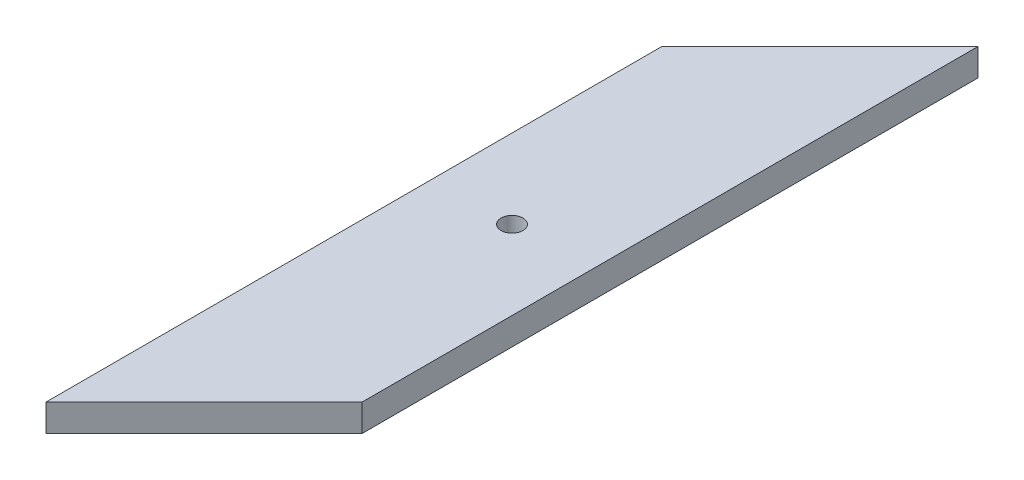
ISO-10303-21;
HEADER;
FILE_DESCRIPTION(('STEP AP214'),'2;1');
FILE_NAME('part.step','',(''),(''),'','','');
FILE_SCHEMA(('AUTOMOTIVE_DESIGN { 1 0 10303 214 1 1 1 1 }'));
ENDSEC;
DATA;
#1=APPLICATION_CONTEXT('core data for automotive mechanical design processes');
#2=APPLICATION_PROTOCOL_DEFINITION('international standard','automotive_design',2000,#1);
#3=PRODUCT_CONTEXT('',#1,'mechanical');
#4=PRODUCT('Part','Part','',(#3));
#5=PRODUCT_RELATED_PRODUCT_CATEGORY('part','',(#4));
#6=PRODUCT_DEFINITION_FORMATION('','',#4);
#7=PRODUCT_DEFINITION_CONTEXT('part definition',#1,'design');
#8=PRODUCT_DEFINITION('design','',#6,#7);
#9=PRODUCT_DEFINITION_SHAPE('','',#8);
#10=(LENGTH_UNIT() NAMED_UNIT(*) SI_UNIT(.MILLI.,.METRE.));
#11=(NAMED_UNIT(*) PLANE_ANGLE_UNIT() SI_UNIT($,.RADIAN.));
#12=(NAMED_UNIT(*) SI_UNIT($,.STERADIAN.) SOLID_ANGLE_UNIT());
#13=UNCERTAINTY_MEASURE_WITH_UNIT(LENGTH_MEASURE(1.E-05),#10,'distance_accuracy_value','');
#14=(GEOMETRIC_REPRESENTATION_CONTEXT(3) GLOBAL_UNCERTAINTY_ASSIGNED_CONTEXT((#13)) GLOBAL_UNIT_ASSIGNED_CONTEXT((#10,
#11,#12)) REPRESENTATION_CONTEXT('',''));
#15=CARTESIAN_POINT('',(0.,0.,0.));
#16=DIRECTION('',(0.,0.,1.));
#17=DIRECTION('',(1.,0.,0.));
#18=AXIS2_PLACEMENT_3D('',#15,#16,#17);
#19=CARTESIAN_POINT('',(0.,5.,0.));
#20=DIRECTION('',(0.,-1.,0.));
#21=DIRECTION('',(0.,0.,-1.));
#22=AXIS2_PLACEMENT_3D('',#19,#20,#21);
#23=PLANE('',#22);
#24=DIRECTION('',(0.707106781186546,0.,-0.707106781186549));
#25=VECTOR('',#24,1.);
#26=CARTESIAN_POINT('',(-91.2784718269618,5.,88.3111227887487));
#27=LINE('',#26,#25);
#28=CARTESIAN_POINT('',(-91.2784718269618,5.,88.3111227887487));
#29=VERTEX_POINT('',#28);
#30=CARTESIAN_POINT('',(-62.2784718269618,5.,59.3111227887486));
#31=VERTEX_POINT('',#30);
#32=EDGE_CURVE('E85',#29,#31,#27,.T.);
#33=ORIENTED_EDGE('',*,*,#32,.T.);
#34=DIRECTION('',(0.,0.,-1.));
#35=VECTOR('',#34,1.);
#36=CARTESIAN_POINT('',(-62.2784718269618,5.,-53.6888772112512));
#37=LINE('',#36,#35);
#38=CARTESIAN_POINT('',(-62.2784718269618,5.,-53.6888772112512));
#39=VERTEX_POINT('',#38);
#40=EDGE_CURVE('E80',#31,#39,#37,.T.);
#41=ORIENTED_EDGE('',*,*,#40,.T.);
#42=DIRECTION('',(-0.707106781186549,0.,0.707106781186546));
#43=VECTOR('',#42,1.);
#44=CARTESIAN_POINT('',(-62.2784718269618,5.,-53.6888772112512));
#45=LINE('',#44,#43);
#46=CARTESIAN_POINT('',(-91.2784718269618,5.,-24.6888772112513));
#47=VERTEX_POINT('',#46);
#48=EDGE_CURVE('E83',#39,#47,#45,.T.);
#49=ORIENTED_EDGE('',*,*,#48,.T.);
#50=DIRECTION('',(0.,0.,1.));
#51=VECTOR('',#50,1.);
#52=CARTESIAN_POINT('',(-91.2784718269618,5.,-24.6888772112513));
#53=LINE('',#52,#51);
#54=EDGE_CURVE('E50',#47,#29,#53,.T.);
#55=ORIENTED_EDGE('',*,*,#54,.T.);
#56=EDGE_LOOP('',(#33,#41,#49,#55));
#57=FACE_BOUND('',#56,.T.);
#58=CARTESIAN_POINT('',(-76.7784718269618,5.,17.3111227887487));
#59=DIRECTION('',(0.,1.,0.));
#60=DIRECTION('',(0.,0.,1.));
#61=AXIS2_PLACEMENT_3D('',#58,#59,#60);
#62=CIRCLE('',#61,2.);
#63=CARTESIAN_POINT('',(-76.7784718269618,5.,19.3111227887487));
#64=VERTEX_POINT('',#63);
#65=EDGE_CURVE('E100',#64,#64,#62,.T.);
#66=ORIENTED_EDGE('',*,*,#65,.F.);
#67=EDGE_LOOP('',(#66));
#68=FACE_BOUND('',#67,.T.);
#69=ADVANCED_FACE('F33',(#57,#68),#23,.F.);
#70=CARTESIAN_POINT('',(0.,0.,0.));
#71=DIRECTION('',(0.,-1.,0.));
#72=DIRECTION('',(0.,0.,-1.));
#73=AXIS2_PLACEMENT_3D('',#70,#71,#72);
#74=PLANE('',#73);
#75=DIRECTION('',(0.707106781186546,0.,-0.707106781186549));
#76=VECTOR('',#75,1.);
#77=CARTESIAN_POINT('',(-91.2784718269618,0.,88.3111227887487));
#78=LINE('',#77,#76);
#79=CARTESIAN_POINT('',(-91.2784718269618,0.,88.3111227887487));
#80=VERTEX_POINT('',#79);
#81=CARTESIAN_POINT('',(-62.2784718269618,0.,59.3111227887486));
#82=VERTEX_POINT('',#81);
#83=EDGE_CURVE('E97',#80,#82,#78,.T.);
#84=ORIENTED_EDGE('',*,*,#83,.F.);
#85=DIRECTION('',(0.,0.,1.));
#86=VECTOR('',#85,1.);
#87=CARTESIAN_POINT('',(-91.2784718269618,0.,-24.6888772112513));
#88=LINE('',#87,#86);
#89=CARTESIAN_POINT('',(-91.2784718269618,0.,-24.6888772112513));
#90=VERTEX_POINT('',#89);
#91=EDGE_CURVE('E73',#90,#80,#88,.T.);
#92=ORIENTED_EDGE('',*,*,#91,.F.);
#93=DIRECTION('',(-0.707106781186549,0.,0.707106781186546));
#94=VECTOR('',#93,1.);
#95=CARTESIAN_POINT('',(-62.2784718269618,0.,-53.6888772112512));
#96=LINE('',#95,#94);
#97=CARTESIAN_POINT('',(-62.2784718269618,0.,-53.6888772112512));
#98=VERTEX_POINT('',#97);
#99=EDGE_CURVE('E67',#98,#90,#96,.T.);
#100=ORIENTED_EDGE('',*,*,#99,.F.);
#101=DIRECTION('',(0.,0.,-1.));
#102=VECTOR('',#101,1.);
#103=CARTESIAN_POINT('',(-62.2784718269618,0.,-53.6888772112512));
#104=LINE('',#103,#102);
#105=EDGE_CURVE('E89',#82,#98,#104,.T.);
#106=ORIENTED_EDGE('',*,*,#105,.F.);
#107=EDGE_LOOP('',(#84,#92,#100,#106));
#108=FACE_BOUND('',#107,.T.);
#109=CARTESIAN_POINT('',(-76.7784718269618,0.,17.3111227887487));
#110=DIRECTION('',(0.,1.,0.));
#111=DIRECTION('',(0.,0.,1.));
#112=AXIS2_PLACEMENT_3D('',#109,#110,#111);
#113=CIRCLE('',#112,2.);
#114=CARTESIAN_POINT('',(-76.7784718269618,0.,19.3111227887487));
#115=VERTEX_POINT('',#114);
#116=EDGE_CURVE('E112',#115,#115,#113,.T.);
#117=ORIENTED_EDGE('',*,*,#116,.T.);
#118=EDGE_LOOP('',(#117));
#119=FACE_BOUND('',#118,.T.);
#120=ADVANCED_FACE('F108',(#108,#119),#74,.T.);
#121=CARTESIAN_POINT('',(-91.2784718269618,5.,88.3111227887487));
#122=DIRECTION('',(-0.707106781186549,0.,-0.707106781186546));
#123=DIRECTION('',(-0.707106781186546,0.,0.707106781186549));
#124=AXIS2_PLACEMENT_3D('',#121,#122,#123);
#125=PLANE('',#124);
#126=ORIENTED_EDGE('',*,*,#83,.T.);
#127=DIRECTION('',(0.,-1.,0.));
#128=VECTOR('',#127,1.);
#129=CARTESIAN_POINT('',(-62.2784718269618,5.,59.3111227887486));
#130=LINE('',#129,#128);
#131=EDGE_CURVE('E11',#31,#82,#130,.T.);
#132=ORIENTED_EDGE('',*,*,#131,.F.);
#133=ORIENTED_EDGE('',*,*,#32,.F.);
#134=DIRECTION('',(0.,-1.,0.));
#135=VECTOR('',#134,1.);
#136=CARTESIAN_POINT('',(-91.2784718269618,5.,88.3111227887487));
#137=LINE('',#136,#135);
#138=EDGE_CURVE('E93',#29,#80,#137,.T.);
#139=ORIENTED_EDGE('',*,*,#138,.T.);
#140=EDGE_LOOP('',(#126,#132,#133,#139));
#141=FACE_BOUND('',#140,.T.);
#142=ADVANCED_FACE('F35',(#141),#125,.F.);
#143=CARTESIAN_POINT('',(-62.2784718269618,5.,-53.6888772112512));
#144=DIRECTION('',(-1.,0.,0.));
#145=DIRECTION('',(0.,0.,1.));
#146=AXIS2_PLACEMENT_3D('',#143,#144,#145);
#147=PLANE('',#146);
#148=ORIENTED_EDGE('',*,*,#105,.T.);
#149=DIRECTION('',(0.,-1.,0.));
#150=VECTOR('',#149,1.);
#151=CARTESIAN_POINT('',(-62.2784718269618,5.,-53.6888772112512));
#152=LINE('',#151,#150);
#153=EDGE_CURVE('E42',#39,#98,#152,.T.);
#154=ORIENTED_EDGE('',*,*,#153,.F.);
#155=ORIENTED_EDGE('',*,*,#40,.F.);
#156=ORIENTED_EDGE('',*,*,#131,.T.);
#157=EDGE_LOOP('',(#148,#154,#155,#156));
#158=FACE_BOUND('',#157,.T.);
#159=ADVANCED_FACE('F88',(#158),#147,.F.);
#160=CARTESIAN_POINT('',(-62.2784718269618,5.,-53.6888772112512));
#161=DIRECTION('',(0.707106781186546,0.,0.707106781186549));
#162=DIRECTION('',(0.707106781186549,0.,-0.707106781186546));
#163=AXIS2_PLACEMENT_3D('',#160,#161,#162);
#164=PLANE('',#163);
#165=ORIENTED_EDGE('',*,*,#99,.T.);
#166=DIRECTION('',(0.,-1.,0.));
#167=VECTOR('',#166,1.);
#168=CARTESIAN_POINT('',(-91.2784718269618,5.,-24.6888772112513));
#169=LINE('',#168,#167);
#170=EDGE_CURVE('E90',#47,#90,#169,.T.);
#171=ORIENTED_EDGE('',*,*,#170,.F.);
#172=ORIENTED_EDGE('',*,*,#48,.F.);
#173=ORIENTED_EDGE('',*,*,#153,.T.);
#174=EDGE_LOOP('',(#165,#171,#172,#173));
#175=FACE_BOUND('',#174,.T.);
#176=ADVANCED_FACE('F91',(#175),#164,.F.);
#177=CARTESIAN_POINT('',(-91.2784718269618,5.,-24.6888772112513));
#178=DIRECTION('',(1.,0.,0.));
#179=DIRECTION('',(0.,0.,-1.));
#180=AXIS2_PLACEMENT_3D('',#177,#178,#179);
#181=PLANE('',#180);
#182=ORIENTED_EDGE('',*,*,#91,.T.);
#183=ORIENTED_EDGE('',*,*,#138,.F.);
#184=ORIENTED_EDGE('',*,*,#54,.F.);
#185=ORIENTED_EDGE('',*,*,#170,.T.);
#186=EDGE_LOOP('',(#182,#183,#184,#185));
#187=FACE_BOUND('',#186,.T.);
#188=ADVANCED_FACE('F105',(#187),#181,.F.);
#189=CARTESIAN_POINT('',(-76.7784718269618,5.,17.3111227887487));
#190=DIRECTION('',(0.,-1.,0.));
#191=DIRECTION('',(0.,0.,-1.));
#192=AXIS2_PLACEMENT_3D('',#189,#190,#191);
#193=CYLINDRICAL_SURFACE('',#192,2.);
#194=ORIENTED_EDGE('',*,*,#65,.T.);
#195=EDGE_LOOP('',(#194));
#196=FACE_BOUND('',#195,.T.);
#197=ORIENTED_EDGE('',*,*,#116,.F.);
#198=EDGE_LOOP('',(#197));
#199=FACE_BOUND('',#198,.T.);
#200=ADVANCED_FACE('F118',(#196,#199),#193,.F.);
#201=CLOSED_SHELL('',(#69,#120,#142,#159,#176,#188,#200));
#202=MANIFOLD_SOLID_BREP('B2',#201);
#203=ADVANCED_BREP_SHAPE_REPRESENTATION('',(#18,#202),#14);
#204=SHAPE_DEFINITION_REPRESENTATION(#9,#203);
ENDSEC;
END-ISO-10303-21;
